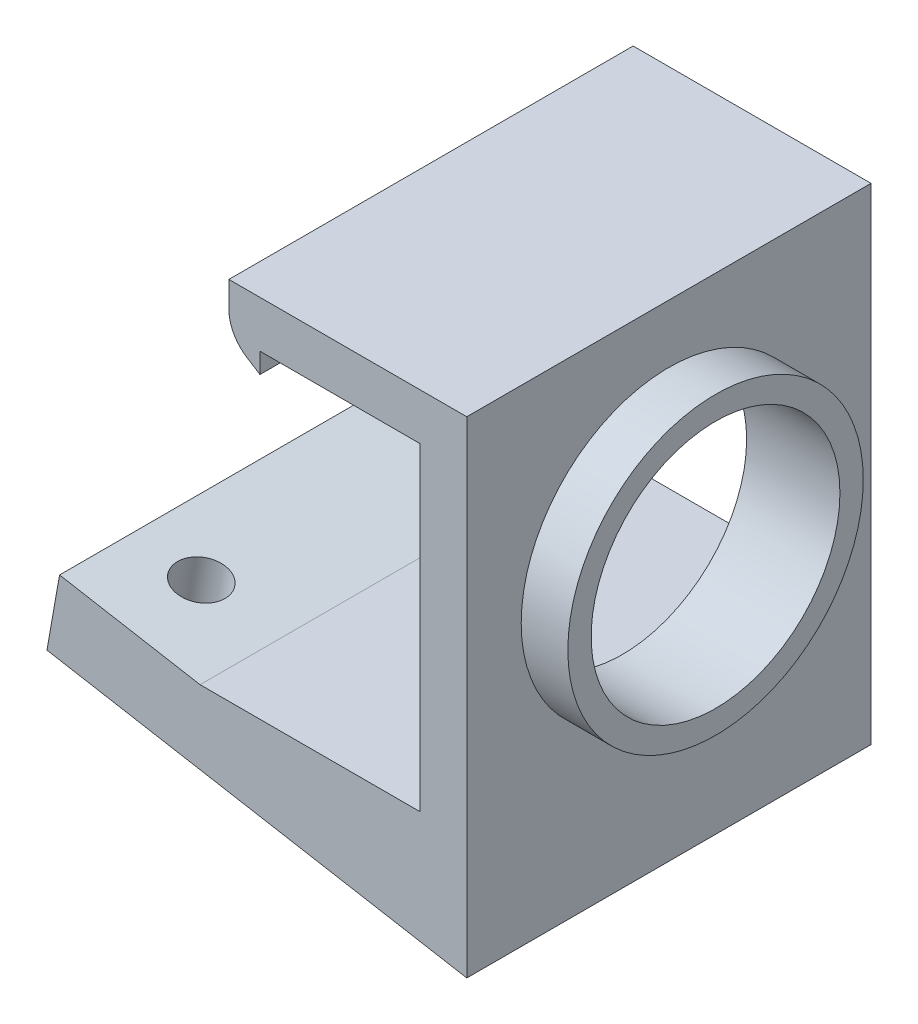
ISO-10303-21;
HEADER;
FILE_DESCRIPTION(('STEP AP214'),'2;1');
FILE_NAME('part.step','',(''),(''),'','','');
FILE_SCHEMA(('AUTOMOTIVE_DESIGN { 1 0 10303 214 1 1 1 1 }'));
ENDSEC;
DATA;
#1=APPLICATION_CONTEXT('core data for automotive mechanical design processes');
#2=APPLICATION_PROTOCOL_DEFINITION('international standard','automotive_design',2000,#1);
#3=PRODUCT_CONTEXT('',#1,'mechanical');
#4=PRODUCT('Part','Part','',(#3));
#5=PRODUCT_RELATED_PRODUCT_CATEGORY('part','',(#4));
#6=PRODUCT_DEFINITION_FORMATION('','',#4);
#7=PRODUCT_DEFINITION_CONTEXT('part definition',#1,'design');
#8=PRODUCT_DEFINITION('design','',#6,#7);
#9=PRODUCT_DEFINITION_SHAPE('','',#8);
#10=(LENGTH_UNIT() NAMED_UNIT(*) SI_UNIT(.MILLI.,.METRE.));
#11=(NAMED_UNIT(*) PLANE_ANGLE_UNIT() SI_UNIT($,.RADIAN.));
#12=(NAMED_UNIT(*) SI_UNIT($,.STERADIAN.) SOLID_ANGLE_UNIT());
#13=UNCERTAINTY_MEASURE_WITH_UNIT(LENGTH_MEASURE(1.E-05),#10,'distance_accuracy_value','');
#14=(GEOMETRIC_REPRESENTATION_CONTEXT(3) GLOBAL_UNCERTAINTY_ASSIGNED_CONTEXT((#13)) GLOBAL_UNIT_ASSIGNED_CONTEXT((#10,
#11,#12)) REPRESENTATION_CONTEXT('',''));
#15=CARTESIAN_POINT('',(0.,0.,0.));
#16=DIRECTION('',(0.,0.,1.));
#17=DIRECTION('',(1.,0.,0.));
#18=AXIS2_PLACEMENT_3D('',#15,#16,#17);
#19=CARTESIAN_POINT('',(0.,3.,26.));
#20=DIRECTION('',(0.,-1.,0.));
#21=DIRECTION('',(0.,0.,-1.));
#22=AXIS2_PLACEMENT_3D('',#19,#20,#21);
#23=PLANE('',#22);
#24=DIRECTION('',(0.,0.,-1.));
#25=VECTOR('',#24,1.);
#26=CARTESIAN_POINT('',(9.84807753012209,3.,53.4165185209151));
#27=LINE('',#26,#25);
#28=CARTESIAN_POINT('',(9.84807753012209,3.,26.));
#29=VERTEX_POINT('',#28);
#30=CARTESIAN_POINT('',(9.84807753012209,3.,0.));
#31=VERTEX_POINT('',#30);
#32=EDGE_CURVE('E154',#29,#31,#27,.T.);
#33=ORIENTED_EDGE('',*,*,#32,.F.);
#34=DIRECTION('',(-1.,0.,0.));
#35=VECTOR('',#34,1.);
#36=CARTESIAN_POINT('',(0.,3.,26.));
#37=LINE('',#36,#35);
#38=CARTESIAN_POINT('',(24.,3.,26.));
#39=VERTEX_POINT('',#38);
#40=EDGE_CURVE('E152',#39,#29,#37,.T.);
#41=ORIENTED_EDGE('',*,*,#40,.F.);
#42=DIRECTION('',(0.,0.,-1.));
#43=VECTOR('',#42,1.);
#44=CARTESIAN_POINT('',(24.,3.,26.));
#45=LINE('',#44,#43);
#46=CARTESIAN_POINT('',(24.,3.,0.));
#47=VERTEX_POINT('',#46);
#48=EDGE_CURVE('E182',#39,#47,#45,.T.);
#49=ORIENTED_EDGE('',*,*,#48,.T.);
#50=DIRECTION('',(-1.,0.,0.));
#51=VECTOR('',#50,1.);
#52=CARTESIAN_POINT('',(0.,3.,0.));
#53=LINE('',#52,#51);
#54=EDGE_CURVE('E65',#47,#31,#53,.T.);
#55=ORIENTED_EDGE('',*,*,#54,.T.);
#56=EDGE_LOOP('',(#33,#41,#49,#55));
#57=FACE_BOUND('',#56,.T.);
#58=ADVANCED_FACE('F41',(#57),#23,.F.);
#59=CARTESIAN_POINT('',(27.,0.,26.));
#60=DIRECTION('',(-1.,0.,0.));
#61=DIRECTION('',(0.,0.,1.));
#62=AXIS2_PLACEMENT_3D('',#59,#60,#61);
#63=PLANE('',#62);
#64=DIRECTION('',(0.,1.,0.));
#65=VECTOR('',#64,1.);
#66=CARTESIAN_POINT('',(27.,0.,0.));
#67=LINE('',#66,#65);
#68=CARTESIAN_POINT('',(27.,-4.76082847912837,0.));
#69=VERTEX_POINT('',#68);
#70=CARTESIAN_POINT('',(27.,26.5,0.));
#71=VERTEX_POINT('',#70);
#72=EDGE_CURVE('E183',#69,#71,#67,.T.);
#73=ORIENTED_EDGE('',*,*,#72,.T.);
#74=DIRECTION('',(0.,0.,-1.));
#75=VECTOR('',#74,1.);
#76=CARTESIAN_POINT('',(27.,26.5,26.));
#77=LINE('',#76,#75);
#78=CARTESIAN_POINT('',(27.,26.5,26.));
#79=VERTEX_POINT('',#78);
#80=EDGE_CURVE('E220',#79,#71,#77,.T.);
#81=ORIENTED_EDGE('',*,*,#80,.F.);
#82=DIRECTION('',(0.,1.,0.));
#83=VECTOR('',#82,1.);
#84=CARTESIAN_POINT('',(27.,0.,26.));
#85=LINE('',#84,#83);
#86=CARTESIAN_POINT('',(27.,-4.76082847912837,26.));
#87=VERTEX_POINT('',#86);
#88=EDGE_CURVE('E165',#87,#79,#85,.T.);
#89=ORIENTED_EDGE('',*,*,#88,.F.);
#90=DIRECTION('',(0.,0.,-1.));
#91=VECTOR('',#90,1.);
#92=CARTESIAN_POINT('',(27.,-4.76082847912837,53.4165185209151));
#93=LINE('',#92,#91);
#94=EDGE_CURVE('E231',#87,#69,#93,.T.);
#95=ORIENTED_EDGE('',*,*,#94,.T.);
#96=EDGE_LOOP('',(#73,#81,#89,#95));
#97=FACE_BOUND('',#96,.T.);
#98=CARTESIAN_POINT('',(27.,13.25,13.));
#99=DIRECTION('',(-1.,0.,0.));
#100=DIRECTION('',(0.,0.,1.));
#101=AXIS2_PLACEMENT_3D('',#98,#99,#100);
#102=CIRCLE('',#101,9.5);
#103=CARTESIAN_POINT('',(27.,13.25,22.5));
#104=VERTEX_POINT('',#103);
#105=EDGE_CURVE('E12',#104,#104,#102,.F.);
#106=ORIENTED_EDGE('',*,*,#105,.F.);
#107=EDGE_LOOP('',(#106));
#108=FACE_BOUND('',#107,.T.);
#109=ADVANCED_FACE('F43',(#97,#108),#63,.F.);
#110=CARTESIAN_POINT('',(11.7,26.5,26.));
#111=DIRECTION('',(0.,-1.,0.));
#112=DIRECTION('',(0.,0.,-1.));
#113=AXIS2_PLACEMENT_3D('',#110,#111,#112);
#114=PLANE('',#113);
#115=DIRECTION('',(-1.,0.,0.));
#116=VECTOR('',#115,1.);
#117=CARTESIAN_POINT('',(11.7,26.5,0.));
#118=LINE('',#117,#116);
#119=CARTESIAN_POINT('',(11.7,26.5,0.));
#120=VERTEX_POINT('',#119);
#121=EDGE_CURVE('E186',#71,#120,#118,.T.);
#122=ORIENTED_EDGE('',*,*,#121,.T.);
#123=DIRECTION('',(0.,0.,-1.));
#124=VECTOR('',#123,1.);
#125=CARTESIAN_POINT('',(11.7,26.5,26.));
#126=LINE('',#125,#124);
#127=CARTESIAN_POINT('',(11.7,26.5,26.));
#128=VERTEX_POINT('',#127);
#129=EDGE_CURVE('E217',#128,#120,#126,.T.);
#130=ORIENTED_EDGE('',*,*,#129,.F.);
#131=DIRECTION('',(-1.,0.,0.));
#132=VECTOR('',#131,1.);
#133=CARTESIAN_POINT('',(13.7,26.5,26.));
#134=LINE('',#133,#132);
#135=EDGE_CURVE('E167',#79,#128,#134,.T.);
#136=ORIENTED_EDGE('',*,*,#135,.F.);
#137=ORIENTED_EDGE('',*,*,#80,.T.);
#138=EDGE_LOOP('',(#122,#130,#136,#137));
#139=FACE_BOUND('',#138,.T.);
#140=ADVANCED_FACE('F256',(#139),#114,.F.);
#141=CARTESIAN_POINT('',(11.7,24.8390609424468,26.));
#142=DIRECTION('',(1.,0.,0.));
#143=DIRECTION('',(0.,0.,-1.));
#144=AXIS2_PLACEMENT_3D('',#141,#142,#143);
#145=PLANE('',#144);
#146=DIRECTION('',(0.,-1.,0.));
#147=VECTOR('',#146,1.);
#148=CARTESIAN_POINT('',(11.7,24.8390609424468,0.));
#149=LINE('',#148,#147);
#150=CARTESIAN_POINT('',(11.7,24.8390609424468,0.));
#151=VERTEX_POINT('',#150);
#152=EDGE_CURVE('E188',#120,#151,#149,.T.);
#153=ORIENTED_EDGE('',*,*,#152,.T.);
#154=DIRECTION('',(0.,0.,-1.));
#155=VECTOR('',#154,1.);
#156=CARTESIAN_POINT('',(11.7,24.8390609424468,26.));
#157=LINE('',#156,#155);
#158=CARTESIAN_POINT('',(11.7,24.8390609424468,26.));
#159=VERTEX_POINT('',#158);
#160=EDGE_CURVE('E214',#159,#151,#157,.T.);
#161=ORIENTED_EDGE('',*,*,#160,.F.);
#162=DIRECTION('',(0.,-1.,0.));
#163=VECTOR('',#162,1.);
#164=CARTESIAN_POINT('',(11.7,24.8390609424468,26.));
#165=LINE('',#164,#163);
#166=EDGE_CURVE('E169',#128,#159,#165,.T.);
#167=ORIENTED_EDGE('',*,*,#166,.F.);
#168=ORIENTED_EDGE('',*,*,#129,.T.);
#169=EDGE_LOOP('',(#153,#161,#167,#168));
#170=FACE_BOUND('',#169,.T.);
#171=ADVANCED_FACE('F261',(#170),#145,.F.);
#172=CARTESIAN_POINT('',(14.2,24.8390609424468,26.));
#173=DIRECTION('',(0.,0.,-1.));
#174=DIRECTION('',(-1.,0.,0.));
#175=AXIS2_PLACEMENT_3D('',#172,#173,#174);
#176=CYLINDRICAL_SURFACE('',#175,2.5);
#177=CARTESIAN_POINT('',(14.2,24.8390609424468,0.));
#178=DIRECTION('',(0.,0.,1.));
#179=DIRECTION('',(-1.,0.,0.));
#180=AXIS2_PLACEMENT_3D('',#177,#178,#179);
#181=CIRCLE('',#180,2.5);
#182=CARTESIAN_POINT('',(12.8686845840841,22.7230270903205,0.));
#183=VERTEX_POINT('',#182);
#184=EDGE_CURVE('E190',#151,#183,#181,.T.);
#185=ORIENTED_EDGE('',*,*,#184,.T.);
#186=DIRECTION('',(0.,0.,-1.));
#187=VECTOR('',#186,1.);
#188=CARTESIAN_POINT('',(12.8686845840841,22.7230270903205,26.));
#189=LINE('',#188,#187);
#190=CARTESIAN_POINT('',(12.8686845840841,22.7230270903205,26.));
#191=VERTEX_POINT('',#190);
#192=EDGE_CURVE('E211',#191,#183,#189,.T.);
#193=ORIENTED_EDGE('',*,*,#192,.F.);
#194=CARTESIAN_POINT('',(14.2,24.8390609424468,26.));
#195=DIRECTION('',(0.,0.,1.));
#196=DIRECTION('',(-1.,0.,0.));
#197=AXIS2_PLACEMENT_3D('',#194,#195,#196);
#198=CIRCLE('',#197,2.5);
#199=EDGE_CURVE('E171',#159,#191,#198,.T.);
#200=ORIENTED_EDGE('',*,*,#199,.F.);
#201=ORIENTED_EDGE('',*,*,#160,.T.);
#202=EDGE_LOOP('',(#185,#193,#200,#201));
#203=FACE_BOUND('',#202,.T.);
#204=ADVANCED_FACE('F267',(#203),#176,.T.);
#205=CARTESIAN_POINT('',(13.7,22.2,26.));
#206=DIRECTION('',(0.532526166366344,0.846413540850549,0.));
#207=DIRECTION('',(-0.84641354085055,0.532526166366344,0.));
#208=AXIS2_PLACEMENT_3D('',#205,#206,#207);
#209=PLANE('',#208);
#210=DIRECTION('',(0.84641354085055,-0.532526166366344,0.));
#211=VECTOR('',#210,1.);
#212=CARTESIAN_POINT('',(13.7,22.2,0.));
#213=LINE('',#212,#211);
#214=CARTESIAN_POINT('',(13.7,22.2,0.));
#215=VERTEX_POINT('',#214);
#216=EDGE_CURVE('E192',#183,#215,#213,.T.);
#217=ORIENTED_EDGE('',*,*,#216,.T.);
#218=DIRECTION('',(0.,0.,-1.));
#219=VECTOR('',#218,1.);
#220=CARTESIAN_POINT('',(13.7,22.2,26.));
#221=LINE('',#220,#219);
#222=CARTESIAN_POINT('',(13.7,22.2,26.));
#223=VERTEX_POINT('',#222);
#224=EDGE_CURVE('E208',#223,#215,#221,.T.);
#225=ORIENTED_EDGE('',*,*,#224,.F.);
#226=DIRECTION('',(0.84641354085055,-0.532526166366344,0.));
#227=VECTOR('',#226,1.);
#228=CARTESIAN_POINT('',(13.7,22.2,26.));
#229=LINE('',#228,#227);
#230=EDGE_CURVE('E173',#191,#223,#229,.T.);
#231=ORIENTED_EDGE('',*,*,#230,.F.);
#232=ORIENTED_EDGE('',*,*,#192,.T.);
#233=EDGE_LOOP('',(#217,#225,#231,#232));
#234=FACE_BOUND('',#233,.T.);
#235=ADVANCED_FACE('F271',(#234),#209,.F.);
#236=CARTESIAN_POINT('',(13.7,23.5,26.));
#237=DIRECTION('',(-1.,0.,0.));
#238=DIRECTION('',(0.,0.,1.));
#239=AXIS2_PLACEMENT_3D('',#236,#237,#238);
#240=PLANE('',#239);
#241=DIRECTION('',(0.,1.,0.));
#242=VECTOR('',#241,1.);
#243=CARTESIAN_POINT('',(13.7,23.5,0.));
#244=LINE('',#243,#242);
#245=CARTESIAN_POINT('',(13.7,23.5,0.));
#246=VERTEX_POINT('',#245);
#247=EDGE_CURVE('E194',#215,#246,#244,.T.);
#248=ORIENTED_EDGE('',*,*,#247,.T.);
#249=DIRECTION('',(0.,0.,-1.));
#250=VECTOR('',#249,1.);
#251=CARTESIAN_POINT('',(13.7,23.5,26.));
#252=LINE('',#251,#250);
#253=CARTESIAN_POINT('',(13.7,23.5,26.));
#254=VERTEX_POINT('',#253);
#255=EDGE_CURVE('E205',#254,#246,#252,.T.);
#256=ORIENTED_EDGE('',*,*,#255,.F.);
#257=DIRECTION('',(0.,1.,0.));
#258=VECTOR('',#257,1.);
#259=CARTESIAN_POINT('',(13.7,23.5,26.));
#260=LINE('',#259,#258);
#261=EDGE_CURVE('E175',#223,#254,#260,.T.);
#262=ORIENTED_EDGE('',*,*,#261,.F.);
#263=ORIENTED_EDGE('',*,*,#224,.T.);
#264=EDGE_LOOP('',(#248,#256,#262,#263));
#265=FACE_BOUND('',#264,.T.);
#266=ADVANCED_FACE('F276',(#265),#240,.F.);
#267=CARTESIAN_POINT('',(13.7,23.5,26.));
#268=DIRECTION('',(0.,1.,0.));
#269=DIRECTION('',(0.,0.,1.));
#270=AXIS2_PLACEMENT_3D('',#267,#268,#269);
#271=PLANE('',#270);
#272=DIRECTION('',(1.,0.,0.));
#273=VECTOR('',#272,1.);
#274=CARTESIAN_POINT('',(13.7,23.5,0.));
#275=LINE('',#274,#273);
#276=CARTESIAN_POINT('',(24.,23.5,0.));
#277=VERTEX_POINT('',#276);
#278=EDGE_CURVE('E196',#246,#277,#275,.T.);
#279=ORIENTED_EDGE('',*,*,#278,.T.);
#280=DIRECTION('',(0.,0.,-1.));
#281=VECTOR('',#280,1.);
#282=CARTESIAN_POINT('',(24.,23.5,26.));
#283=LINE('',#282,#281);
#284=CARTESIAN_POINT('',(24.,23.5,26.));
#285=VERTEX_POINT('',#284);
#286=EDGE_CURVE('E202',#285,#277,#283,.T.);
#287=ORIENTED_EDGE('',*,*,#286,.F.);
#288=DIRECTION('',(1.,0.,0.));
#289=VECTOR('',#288,1.);
#290=CARTESIAN_POINT('',(13.7,23.5,26.));
#291=LINE('',#290,#289);
#292=EDGE_CURVE('E177',#254,#285,#291,.T.);
#293=ORIENTED_EDGE('',*,*,#292,.F.);
#294=ORIENTED_EDGE('',*,*,#255,.T.);
#295=EDGE_LOOP('',(#279,#287,#293,#294));
#296=FACE_BOUND('',#295,.T.);
#297=ADVANCED_FACE('F282',(#296),#271,.F.);
#298=CARTESIAN_POINT('',(24.,23.5,26.));
#299=DIRECTION('',(1.,0.,0.));
#300=DIRECTION('',(0.,1.,0.));
#301=AXIS2_PLACEMENT_3D('',#298,#299,#300);
#302=PLANE('',#301);
#303=CARTESIAN_POINT('',(24.,13.25,13.));
#304=DIRECTION('',(1.,0.,0.));
#305=DIRECTION('',(0.,1.,0.));
#306=AXIS2_PLACEMENT_3D('',#303,#304,#305);
#307=CIRCLE('',#306,8.);
#308=CARTESIAN_POINT('',(24.,21.25,13.));
#309=VERTEX_POINT('',#308);
#310=EDGE_CURVE('E164',#309,#309,#307,.T.);
#311=ORIENTED_EDGE('',*,*,#310,.T.);
#312=EDGE_LOOP('',(#311));
#313=FACE_BOUND('',#312,.T.);
#314=DIRECTION('',(0.,-1.,0.));
#315=VECTOR('',#314,1.);
#316=CARTESIAN_POINT('',(24.,23.5,0.));
#317=LINE('',#316,#315);
#318=EDGE_CURVE('E198',#277,#47,#317,.T.);
#319=ORIENTED_EDGE('',*,*,#318,.T.);
#320=ORIENTED_EDGE('',*,*,#48,.F.);
#321=DIRECTION('',(0.,-1.,0.));
#322=VECTOR('',#321,1.);
#323=CARTESIAN_POINT('',(24.,23.5,26.));
#324=LINE('',#323,#322);
#325=EDGE_CURVE('E179',#285,#39,#324,.T.);
#326=ORIENTED_EDGE('',*,*,#325,.F.);
#327=ORIENTED_EDGE('',*,*,#286,.T.);
#328=EDGE_LOOP('',(#319,#320,#326,#327));
#329=FACE_BOUND('',#328,.T.);
#330=ADVANCED_FACE('F286',(#313,#329),#302,.F.);
#331=CARTESIAN_POINT('',(14.2,24.8390609424468,26.));
#332=DIRECTION('',(0.,0.,-1.));
#333=DIRECTION('',(-1.,0.,0.));
#334=AXIS2_PLACEMENT_3D('',#331,#332,#333);
#335=PLANE('',#334);
#336=DIRECTION('',(0.984807753012209,-0.173648177666923,0.));
#337=VECTOR('',#336,1.);
#338=CARTESIAN_POINT('',(0.809986088057883,4.59365937534613,26.));
#339=LINE('',#338,#337);
#340=CARTESIAN_POINT('',(0.809986088057884,4.59365937534613,26.));
#341=VERTEX_POINT('',#340);
#342=EDGE_CURVE('E58',#341,#29,#339,.T.);
#343=ORIENTED_EDGE('',*,*,#342,.F.);
#344=DIRECTION('',(-0.173648177666924,-0.984807753012209,0.));
#345=VECTOR('',#344,1.);
#346=CARTESIAN_POINT('',(0.,0.,26.));
#347=LINE('',#346,#345);
#348=CARTESIAN_POINT('',(0.,0.,26.));
#349=VERTEX_POINT('',#348);
#350=EDGE_CURVE('E133',#341,#349,#347,.T.);
#351=ORIENTED_EDGE('',*,*,#350,.T.);
#352=DIRECTION('',(0.984807753012209,-0.173648177666924,0.));
#353=VECTOR('',#352,1.);
#354=CARTESIAN_POINT('',(27.,-4.76082847912837,26.));
#355=LINE('',#354,#353);
#356=EDGE_CURVE('E227',#349,#87,#355,.T.);
#357=ORIENTED_EDGE('',*,*,#356,.T.);
#358=ORIENTED_EDGE('',*,*,#88,.T.);
#359=ORIENTED_EDGE('',*,*,#135,.T.);
#360=ORIENTED_EDGE('',*,*,#166,.T.);
#361=ORIENTED_EDGE('',*,*,#199,.T.);
#362=ORIENTED_EDGE('',*,*,#230,.T.);
#363=ORIENTED_EDGE('',*,*,#261,.T.);
#364=ORIENTED_EDGE('',*,*,#292,.T.);
#365=ORIENTED_EDGE('',*,*,#325,.T.);
#366=ORIENTED_EDGE('',*,*,#40,.T.);
#367=EDGE_LOOP('',(#343,#351,#357,#358,#359,#360,#361,#362,#363,#364,#365,#366));
#368=FACE_BOUND('',#367,.T.);
#369=ADVANCED_FACE('F150',(#368),#335,.F.);
#370=CARTESIAN_POINT('',(14.2,24.8390609424468,0.));
#371=DIRECTION('',(0.,0.,-1.));
#372=DIRECTION('',(-1.,0.,0.));
#373=AXIS2_PLACEMENT_3D('',#370,#371,#372);
#374=PLANE('',#373);
#375=DIRECTION('',(-0.173648177666924,-0.984807753012209,0.));
#376=VECTOR('',#375,1.);
#377=CARTESIAN_POINT('',(0.,0.,0.));
#378=LINE('',#377,#376);
#379=CARTESIAN_POINT('',(0.809986088057884,4.59365937534613,0.));
#380=VERTEX_POINT('',#379);
#381=CARTESIAN_POINT('',(0.,0.,0.));
#382=VERTEX_POINT('',#381);
#383=EDGE_CURVE('E141',#380,#382,#378,.T.);
#384=ORIENTED_EDGE('',*,*,#383,.F.);
#385=DIRECTION('',(-0.984807753012209,0.173648177666923,0.));
#386=VECTOR('',#385,1.);
#387=CARTESIAN_POINT('',(0.809986088057883,4.59365937534613,0.));
#388=LINE('',#387,#386);
#389=EDGE_CURVE('E146',#31,#380,#388,.T.);
#390=ORIENTED_EDGE('',*,*,#389,.F.);
#391=ORIENTED_EDGE('',*,*,#54,.F.);
#392=ORIENTED_EDGE('',*,*,#318,.F.);
#393=ORIENTED_EDGE('',*,*,#278,.F.);
#394=ORIENTED_EDGE('',*,*,#247,.F.);
#395=ORIENTED_EDGE('',*,*,#216,.F.);
#396=ORIENTED_EDGE('',*,*,#184,.F.);
#397=ORIENTED_EDGE('',*,*,#152,.F.);
#398=ORIENTED_EDGE('',*,*,#121,.F.);
#399=ORIENTED_EDGE('',*,*,#72,.F.);
#400=DIRECTION('',(-0.984807753012209,0.173648177666924,0.));
#401=VECTOR('',#400,1.);
#402=CARTESIAN_POINT('',(27.,-4.76082847912837,0.));
#403=LINE('',#402,#401);
#404=EDGE_CURVE('E242',#69,#382,#403,.T.);
#405=ORIENTED_EDGE('',*,*,#404,.T.);
#406=EDGE_LOOP('',(#384,#390,#391,#392,#393,#394,#395,#396,#397,#398,#399,#405));
#407=FACE_BOUND('',#406,.T.);
#408=ADVANCED_FACE('F246',(#407),#374,.T.);
#409=CARTESIAN_POINT('',(0.999999999999997,13.25,13.));
#410=DIRECTION('',(1.,0.,0.));
#411=DIRECTION('',(0.,0.,-1.));
#412=AXIS2_PLACEMENT_3D('',#409,#410,#411);
#413=CYLINDRICAL_SURFACE('',#412,8.);
#414=ORIENTED_EDGE('',*,*,#310,.F.);
#415=EDGE_LOOP('',(#414));
#416=FACE_BOUND('',#415,.T.);
#417=CARTESIAN_POINT('',(30.,13.25,13.));
#418=DIRECTION('',(1.,0.,0.));
#419=DIRECTION('',(0.,0.,-1.));
#420=AXIS2_PLACEMENT_3D('',#417,#418,#419);
#421=CIRCLE('',#420,8.);
#422=CARTESIAN_POINT('',(30.,13.25,5.));
#423=VERTEX_POINT('',#422);
#424=EDGE_CURVE('E153',#423,#423,#421,.T.);
#425=ORIENTED_EDGE('',*,*,#424,.T.);
#426=EDGE_LOOP('',(#425));
#427=FACE_BOUND('',#426,.T.);
#428=ADVANCED_FACE('F349',(#416,#427),#413,.F.);
#429=CARTESIAN_POINT('',(30.,13.25,13.));
#430=DIRECTION('',(1.,0.,0.));
#431=DIRECTION('',(0.,0.,-1.));
#432=AXIS2_PLACEMENT_3D('',#429,#430,#431);
#433=PLANE('',#432);
#434=CARTESIAN_POINT('',(30.,13.25,13.));
#435=DIRECTION('',(1.,0.,0.));
#436=DIRECTION('',(0.,0.,-1.));
#437=AXIS2_PLACEMENT_3D('',#434,#435,#436);
#438=CIRCLE('',#437,9.5);
#439=CARTESIAN_POINT('',(30.,13.25,3.5));
#440=VERTEX_POINT('',#439);
#441=EDGE_CURVE('E157',#440,#440,#438,.T.);
#442=ORIENTED_EDGE('',*,*,#441,.T.);
#443=EDGE_LOOP('',(#442));
#444=FACE_BOUND('',#443,.T.);
#445=ORIENTED_EDGE('',*,*,#424,.F.);
#446=EDGE_LOOP('',(#445));
#447=FACE_BOUND('',#446,.T.);
#448=ADVANCED_FACE('F355',(#444,#447),#433,.T.);
#449=CARTESIAN_POINT('',(30.,13.25,13.));
#450=DIRECTION('',(-1.,0.,0.));
#451=DIRECTION('',(0.,0.,1.));
#452=AXIS2_PLACEMENT_3D('',#449,#450,#451);
#453=CYLINDRICAL_SURFACE('',#452,9.5);
#454=ORIENTED_EDGE('',*,*,#441,.F.);
#455=EDGE_LOOP('',(#454));
#456=FACE_BOUND('',#455,.T.);
#457=ORIENTED_EDGE('',*,*,#105,.T.);
#458=EDGE_LOOP('',(#457));
#459=FACE_BOUND('',#458,.T.);
#460=ADVANCED_FACE('F363',(#456,#459),#453,.T.);
#461=CARTESIAN_POINT('',(0.809986088057883,4.59365937534613,53.4165185209151));
#462=DIRECTION('',(-0.173648177666923,-0.984807753012209,0.));
#463=DIRECTION('',(0.984807753012209,-0.173648177666923,0.));
#464=AXIS2_PLACEMENT_3D('',#461,#462,#463);
#465=PLANE('',#464);
#466=CARTESIAN_POINT('',(4.92403876506105,3.86824088833462,21.));
#467=DIRECTION('',(0.173648177666923,0.984807753012209,0.));
#468=DIRECTION('',(-0.984807753012209,0.173648177666923,0.));
#469=AXIS2_PLACEMENT_3D('',#466,#467,#468);
#470=CIRCLE('',#469,1.55);
#471=CARTESIAN_POINT('',(3.39758674789212,4.13739556371835,21.));
#472=VERTEX_POINT('',#471);
#473=EDGE_CURVE('E147',#472,#472,#470,.T.);
#474=ORIENTED_EDGE('',*,*,#473,.F.);
#475=EDGE_LOOP('',(#474));
#476=FACE_BOUND('',#475,.T.);
#477=CARTESIAN_POINT('',(4.92403876506105,3.86824088833462,5.));
#478=DIRECTION('',(0.173648177666923,0.984807753012209,0.));
#479=DIRECTION('',(-0.984807753012209,0.173648177666923,0.));
#480=AXIS2_PLACEMENT_3D('',#477,#478,#479);
#481=CIRCLE('',#480,1.55);
#482=CARTESIAN_POINT('',(3.39758674789212,4.13739556371835,5.));
#483=VERTEX_POINT('',#482);
#484=EDGE_CURVE('E228',#483,#483,#481,.T.);
#485=ORIENTED_EDGE('',*,*,#484,.F.);
#486=EDGE_LOOP('',(#485));
#487=FACE_BOUND('',#486,.T.);
#488=ORIENTED_EDGE('',*,*,#389,.T.);
#489=DIRECTION('',(0.,0.,-1.));
#490=VECTOR('',#489,1.);
#491=CARTESIAN_POINT('',(0.809986088057884,4.59365937534613,26.));
#492=LINE('',#491,#490);
#493=EDGE_CURVE('E135',#341,#380,#492,.T.);
#494=ORIENTED_EDGE('',*,*,#493,.F.);
#495=ORIENTED_EDGE('',*,*,#342,.T.);
#496=ORIENTED_EDGE('',*,*,#32,.T.);
#497=EDGE_LOOP('',(#488,#494,#495,#496));
#498=FACE_BOUND('',#497,.T.);
#499=ADVANCED_FACE('F144',(#476,#487,#498),#465,.F.);
#500=CARTESIAN_POINT('',(27.,-4.76082847912837,53.4165185209151));
#501=DIRECTION('',(-0.173648177666924,-0.984807753012209,0.));
#502=DIRECTION('',(0.984807753012209,-0.173648177666924,0.));
#503=AXIS2_PLACEMENT_3D('',#500,#501,#502);
#504=PLANE('',#503);
#505=CARTESIAN_POINT('',(4.11405267700316,-0.725418487011517,21.));
#506=DIRECTION('',(-0.173648177666924,-0.984807753012209,0.));
#507=DIRECTION('',(0.984807753012209,-0.173648177666924,0.));
#508=AXIS2_PLACEMENT_3D('',#505,#506,#507);
#509=CIRCLE('',#508,1.55);
#510=CARTESIAN_POINT('',(5.64050469417209,-0.994573162395249,21.));
#511=VERTEX_POINT('',#510);
#512=EDGE_CURVE('E45',#511,#511,#509,.T.);
#513=ORIENTED_EDGE('',*,*,#512,.F.);
#514=EDGE_LOOP('',(#513));
#515=FACE_BOUND('',#514,.T.);
#516=CARTESIAN_POINT('',(4.11405267700316,-0.725418487011517,5.));
#517=DIRECTION('',(-0.173648177666924,-0.984807753012209,0.));
#518=DIRECTION('',(0.984807753012209,-0.173648177666924,0.));
#519=AXIS2_PLACEMENT_3D('',#516,#517,#518);
#520=CIRCLE('',#519,1.55);
#521=CARTESIAN_POINT('',(5.64050469417209,-0.994573162395249,5.));
#522=VERTEX_POINT('',#521);
#523=EDGE_CURVE('E225',#522,#522,#520,.T.);
#524=ORIENTED_EDGE('',*,*,#523,.F.);
#525=EDGE_LOOP('',(#524));
#526=FACE_BOUND('',#525,.T.);
#527=ORIENTED_EDGE('',*,*,#356,.F.);
#528=DIRECTION('',(0.,0.,-1.));
#529=VECTOR('',#528,1.);
#530=CARTESIAN_POINT('',(0.,0.,26.));
#531=LINE('',#530,#529);
#532=EDGE_CURVE('E50',#349,#382,#531,.T.);
#533=ORIENTED_EDGE('',*,*,#532,.T.);
#534=ORIENTED_EDGE('',*,*,#404,.F.);
#535=ORIENTED_EDGE('',*,*,#94,.F.);
#536=EDGE_LOOP('',(#527,#533,#534,#535));
#537=FACE_BOUND('',#536,.T.);
#538=ADVANCED_FACE('F249',(#515,#526,#537),#504,.T.);
#539=CARTESIAN_POINT('',(3.29990305761299,-5.34269042190787,5.));
#540=DIRECTION('',(0.173648177666923,0.984807753012209,0.));
#541=DIRECTION('',(-0.984807753012209,0.173648177666923,0.));
#542=AXIS2_PLACEMENT_3D('',#539,#540,#541);
#543=CYLINDRICAL_SURFACE('',#542,1.55);
#544=ORIENTED_EDGE('',*,*,#523,.T.);
#545=EDGE_LOOP('',(#544));
#546=FACE_BOUND('',#545,.T.);
#547=ORIENTED_EDGE('',*,*,#484,.T.);
#548=EDGE_LOOP('',(#547));
#549=FACE_BOUND('',#548,.T.);
#550=ADVANCED_FACE('F384',(#546,#549),#543,.F.);
#551=CARTESIAN_POINT('',(3.29990305761299,-5.34269042190787,21.));
#552=DIRECTION('',(0.173648177666923,0.984807753012209,0.));
#553=DIRECTION('',(-0.984807753012209,0.173648177666923,0.));
#554=AXIS2_PLACEMENT_3D('',#551,#552,#553);
#555=CYLINDRICAL_SURFACE('',#554,1.55);
#556=ORIENTED_EDGE('',*,*,#512,.T.);
#557=EDGE_LOOP('',(#556));
#558=FACE_BOUND('',#557,.T.);
#559=ORIENTED_EDGE('',*,*,#473,.T.);
#560=EDGE_LOOP('',(#559));
#561=FACE_BOUND('',#560,.T.);
#562=ADVANCED_FACE('F393',(#558,#561),#555,.F.);
#563=CARTESIAN_POINT('',(0.,0.,26.));
#564=DIRECTION('',(0.984807753012209,-0.173648177666924,0.));
#565=DIRECTION('',(0.173648177666924,0.984807753012209,0.));
#566=AXIS2_PLACEMENT_3D('',#563,#564,#565);
#567=PLANE('',#566);
#568=ORIENTED_EDGE('',*,*,#383,.T.);
#569=ORIENTED_EDGE('',*,*,#532,.F.);
#570=ORIENTED_EDGE('',*,*,#350,.F.);
#571=ORIENTED_EDGE('',*,*,#493,.T.);
#572=EDGE_LOOP('',(#568,#569,#570,#571));
#573=FACE_BOUND('',#572,.T.);
#574=ADVANCED_FACE('F134',(#573),#567,.F.);
#575=CLOSED_SHELL('',(#58,#109,#140,#171,#204,#235,#266,#297,#330,#369,#408,#428,#448,#460,#499,
#538,#550,#562,#574));
#576=MANIFOLD_SOLID_BREP('B2',#575);
#577=ADVANCED_BREP_SHAPE_REPRESENTATION('',(#18,#576),#14);
#578=SHAPE_DEFINITION_REPRESENTATION(#9,#577);
ENDSEC;
END-ISO-10303-21;
